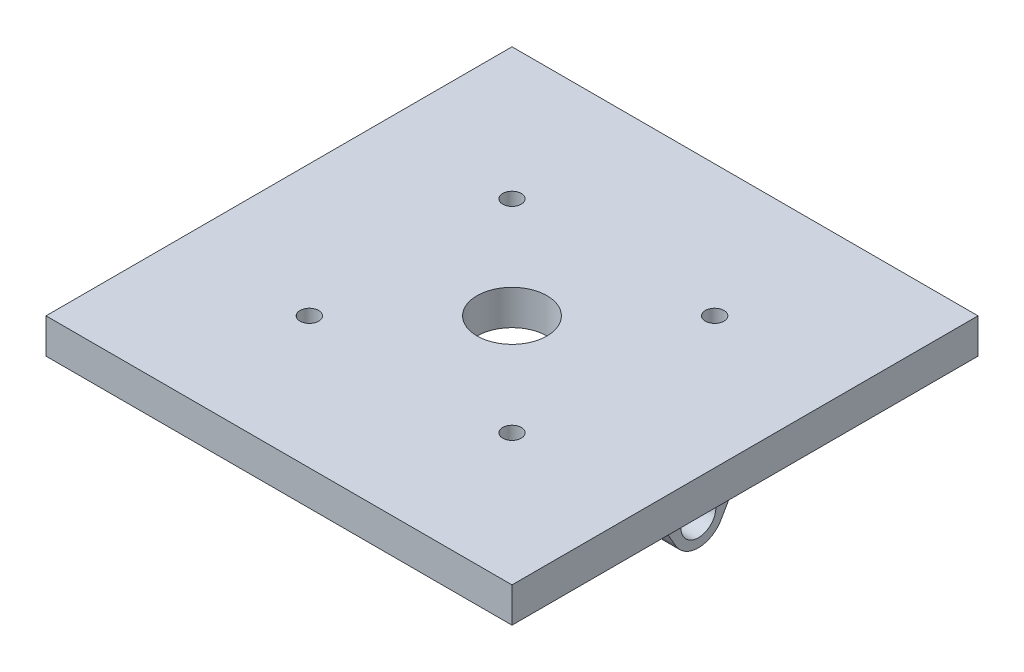
ISO-10303-21;
HEADER;
FILE_DESCRIPTION(('STEP AP214'),'2;1');
FILE_NAME('part.step','',(''),(''),'','','');
FILE_SCHEMA(('AUTOMOTIVE_DESIGN { 1 0 10303 214 1 1 1 1 }'));
ENDSEC;
DATA;
#1=APPLICATION_CONTEXT('core data for automotive mechanical design processes');
#2=APPLICATION_PROTOCOL_DEFINITION('international standard','automotive_design',2000,#1);
#3=PRODUCT_CONTEXT('',#1,'mechanical');
#4=PRODUCT('Part','Part','',(#3));
#5=PRODUCT_RELATED_PRODUCT_CATEGORY('part','',(#4));
#6=PRODUCT_DEFINITION_FORMATION('','',#4);
#7=PRODUCT_DEFINITION_CONTEXT('part definition',#1,'design');
#8=PRODUCT_DEFINITION('design','',#6,#7);
#9=PRODUCT_DEFINITION_SHAPE('','',#8);
#10=(LENGTH_UNIT() NAMED_UNIT(*) SI_UNIT(.MILLI.,.METRE.));
#11=(NAMED_UNIT(*) PLANE_ANGLE_UNIT() SI_UNIT($,.RADIAN.));
#12=(NAMED_UNIT(*) SI_UNIT($,.STERADIAN.) SOLID_ANGLE_UNIT());
#13=UNCERTAINTY_MEASURE_WITH_UNIT(LENGTH_MEASURE(1.E-05),#10,'distance_accuracy_value','');
#14=(GEOMETRIC_REPRESENTATION_CONTEXT(3) GLOBAL_UNCERTAINTY_ASSIGNED_CONTEXT((#13)) GLOBAL_UNIT_ASSIGNED_CONTEXT((#10,
#11,#12)) REPRESENTATION_CONTEXT('',''));
#15=CARTESIAN_POINT('',(0.,0.,0.));
#16=DIRECTION('',(0.,0.,1.));
#17=DIRECTION('',(1.,0.,0.));
#18=AXIS2_PLACEMENT_3D('',#15,#16,#17);
#19=CARTESIAN_POINT('',(0.,0.,0.));
#20=DIRECTION('',(0.,-1.,0.));
#21=DIRECTION('',(0.,0.,-1.));
#22=AXIS2_PLACEMENT_3D('',#19,#20,#21);
#23=PLANE('',#22);
#24=CARTESIAN_POINT('',(-86.974,0.,86.974));
#25=DIRECTION('',(0.,-1.,0.));
#26=DIRECTION('',(0.,0.,-1.));
#27=AXIS2_PLACEMENT_3D('',#24,#25,#26);
#28=CIRCLE('',#27,8.00000000000003);
#29=CARTESIAN_POINT('',(-86.974,0.,78.974));
#30=VERTEX_POINT('',#29);
#31=EDGE_CURVE('E413',#30,#30,#28,.T.);
#32=ORIENTED_EDGE('',*,*,#31,.F.);
#33=EDGE_LOOP('',(#32));
#34=FACE_BOUND('',#33,.T.);
#35=CARTESIAN_POINT('',(86.974,0.,86.974));
#36=DIRECTION('',(0.,-1.,0.));
#37=DIRECTION('',(0.,0.,-1.));
#38=AXIS2_PLACEMENT_3D('',#35,#36,#37);
#39=CIRCLE('',#38,8.00000000000004);
#40=CARTESIAN_POINT('',(86.974,0.,78.974));
#41=VERTEX_POINT('',#40);
#42=EDGE_CURVE('E423',#41,#41,#39,.T.);
#43=ORIENTED_EDGE('',*,*,#42,.F.);
#44=EDGE_LOOP('',(#43));
#45=FACE_BOUND('',#44,.T.);
#46=CARTESIAN_POINT('',(86.974,0.,-86.974));
#47=DIRECTION('',(0.,-1.,0.));
#48=DIRECTION('',(0.,0.,-1.));
#49=AXIS2_PLACEMENT_3D('',#46,#47,#48);
#50=CIRCLE('',#49,8.00000000000004);
#51=CARTESIAN_POINT('',(86.974,0.,-94.974));
#52=VERTEX_POINT('',#51);
#53=EDGE_CURVE('E429',#52,#52,#50,.T.);
#54=ORIENTED_EDGE('',*,*,#53,.F.);
#55=EDGE_LOOP('',(#54));
#56=FACE_BOUND('',#55,.T.);
#57=CARTESIAN_POINT('',(-86.974,0.,-86.974));
#58=DIRECTION('',(0.,-1.,0.));
#59=DIRECTION('',(0.,0.,-1.));
#60=AXIS2_PLACEMENT_3D('',#57,#58,#59);
#61=CIRCLE('',#60,8.00000000000003);
#62=CARTESIAN_POINT('',(-86.974,0.,-94.974));
#63=VERTEX_POINT('',#62);
#64=EDGE_CURVE('E435',#63,#63,#61,.T.);
#65=ORIENTED_EDGE('',*,*,#64,.F.);
#66=EDGE_LOOP('',(#65));
#67=FACE_BOUND('',#66,.T.);
#68=DIRECTION('',(0.,0.,1.));
#69=VECTOR('',#68,1.);
#70=CARTESIAN_POINT('',(-160.,0.,57.7350269189629));
#71=LINE('',#70,#69);
#72=CARTESIAN_POINT('',(-160.,0.,-57.7350269189629));
#73=VERTEX_POINT('',#72);
#74=CARTESIAN_POINT('',(-160.,0.,57.7350269189629));
#75=VERTEX_POINT('',#74);
#76=EDGE_CURVE('E176',#73,#75,#71,.T.);
#77=ORIENTED_EDGE('',*,*,#76,.T.);
#78=DIRECTION('',(1.,0.,0.));
#79=VECTOR('',#78,1.);
#80=CARTESIAN_POINT('',(-160.,0.,57.7350269189629));
#81=LINE('',#80,#79);
#82=CARTESIAN_POINT('',(-130.,0.,57.7350269189629));
#83=VERTEX_POINT('',#82);
#84=EDGE_CURVE('E203',#75,#83,#81,.T.);
#85=ORIENTED_EDGE('',*,*,#84,.T.);
#86=DIRECTION('',(0.,0.,1.));
#87=VECTOR('',#86,1.);
#88=CARTESIAN_POINT('',(-130.,0.,57.7350269189629));
#89=LINE('',#88,#87);
#90=CARTESIAN_POINT('',(-130.,0.,-57.7350269189629));
#91=VERTEX_POINT('',#90);
#92=EDGE_CURVE('E194',#91,#83,#89,.T.);
#93=ORIENTED_EDGE('',*,*,#92,.F.);
#94=DIRECTION('',(1.,0.,0.));
#95=VECTOR('',#94,1.);
#96=CARTESIAN_POINT('',(-160.,0.,-57.7350269189629));
#97=LINE('',#96,#95);
#98=EDGE_CURVE('E201',#73,#91,#97,.T.);
#99=ORIENTED_EDGE('',*,*,#98,.F.);
#100=EDGE_LOOP('',(#77,#85,#93,#99));
#101=FACE_BOUND('',#100,.T.);
#102=DIRECTION('',(0.,0.,-1.));
#103=VECTOR('',#102,1.);
#104=CARTESIAN_POINT('',(200.,0.,200.));
#105=LINE('',#104,#103);
#106=CARTESIAN_POINT('',(200.,0.,200.));
#107=VERTEX_POINT('',#106);
#108=CARTESIAN_POINT('',(200.,0.,-200.));
#109=VERTEX_POINT('',#108);
#110=EDGE_CURVE('E259',#107,#109,#105,.T.);
#111=ORIENTED_EDGE('',*,*,#110,.F.);
#112=DIRECTION('',(1.,0.,0.));
#113=VECTOR('',#112,1.);
#114=CARTESIAN_POINT('',(-200.,0.,200.));
#115=LINE('',#114,#113);
#116=CARTESIAN_POINT('',(-200.,0.,200.));
#117=VERTEX_POINT('',#116);
#118=EDGE_CURVE('E266',#117,#107,#115,.T.);
#119=ORIENTED_EDGE('',*,*,#118,.F.);
#120=DIRECTION('',(0.,0.,1.));
#121=VECTOR('',#120,1.);
#122=CARTESIAN_POINT('',(-200.,0.,200.));
#123=LINE('',#122,#121);
#124=CARTESIAN_POINT('',(-200.,0.,-200.));
#125=VERTEX_POINT('',#124);
#126=EDGE_CURVE('E277',#125,#117,#123,.T.);
#127=ORIENTED_EDGE('',*,*,#126,.F.);
#128=DIRECTION('',(-1.,0.,0.));
#129=VECTOR('',#128,1.);
#130=CARTESIAN_POINT('',(-200.,0.,-200.));
#131=LINE('',#130,#129);
#132=EDGE_CURVE('E275',#109,#125,#131,.T.);
#133=ORIENTED_EDGE('',*,*,#132,.F.);
#134=EDGE_LOOP('',(#111,#119,#127,#133));
#135=FACE_BOUND('',#134,.T.);
#136=CARTESIAN_POINT('',(0.,0.,0.));
#137=DIRECTION('',(0.,1.,0.));
#138=DIRECTION('',(0.,0.,1.));
#139=AXIS2_PLACEMENT_3D('',#136,#137,#138);
#140=CIRCLE('',#139,30.);
#141=CARTESIAN_POINT('',(0.,0.,30.));
#142=VERTEX_POINT('',#141);
#143=EDGE_CURVE('E255',#142,#142,#140,.T.);
#144=ORIENTED_EDGE('',*,*,#143,.T.);
#145=EDGE_LOOP('',(#144));
#146=FACE_BOUND('',#145,.T.);
#147=DIRECTION('',(0.,0.,1.));
#148=VECTOR('',#147,1.);
#149=CARTESIAN_POINT('',(160.,0.,57.7350269189629));
#150=LINE('',#149,#148);
#151=CARTESIAN_POINT('',(160.,0.,-57.7350269189629));
#152=VERTEX_POINT('',#151);
#153=CARTESIAN_POINT('',(160.,0.,57.7350269189629));
#154=VERTEX_POINT('',#153);
#155=EDGE_CURVE('E56',#152,#154,#150,.T.);
#156=ORIENTED_EDGE('',*,*,#155,.F.);
#157=DIRECTION('',(-1.,0.,0.));
#158=VECTOR('',#157,1.);
#159=CARTESIAN_POINT('',(160.,0.,-57.7350269189629));
#160=LINE('',#159,#158);
#161=CARTESIAN_POINT('',(130.,0.,-57.7350269189629));
#162=VERTEX_POINT('',#161);
#163=EDGE_CURVE('E247',#152,#162,#160,.T.);
#164=ORIENTED_EDGE('',*,*,#163,.T.);
#165=DIRECTION('',(0.,0.,1.));
#166=VECTOR('',#165,1.);
#167=CARTESIAN_POINT('',(130.,0.,57.7350269189629));
#168=LINE('',#167,#166);
#169=CARTESIAN_POINT('',(130.,0.,57.7350269189629));
#170=VERTEX_POINT('',#169);
#171=EDGE_CURVE('E234',#162,#170,#168,.T.);
#172=ORIENTED_EDGE('',*,*,#171,.T.);
#173=DIRECTION('',(-1.,0.,0.));
#174=VECTOR('',#173,1.);
#175=CARTESIAN_POINT('',(160.,0.,57.7350269189629));
#176=LINE('',#175,#174);
#177=EDGE_CURVE('E244',#154,#170,#176,.T.);
#178=ORIENTED_EDGE('',*,*,#177,.F.);
#179=EDGE_LOOP('',(#156,#164,#172,#178));
#180=FACE_BOUND('',#179,.T.);
#181=ADVANCED_FACE('F33',(#34,#45,#56,#67,#101,#135,#146,#180),#23,.T.);
#182=CARTESIAN_POINT('',(0.,30.,0.));
#183=DIRECTION('',(0.,-1.,0.));
#184=DIRECTION('',(0.,0.,-1.));
#185=AXIS2_PLACEMENT_3D('',#182,#183,#184);
#186=PLANE('',#185);
#187=CARTESIAN_POINT('',(-86.974,30.,86.974));
#188=DIRECTION('',(0.,1.,0.));
#189=DIRECTION('',(0.,0.,-1.));
#190=AXIS2_PLACEMENT_3D('',#187,#188,#189);
#191=CIRCLE('',#190,8.00000000000003);
#192=CARTESIAN_POINT('',(-86.974,30.,78.974));
#193=VERTEX_POINT('',#192);
#194=EDGE_CURVE('E416',#193,#193,#191,.T.);
#195=ORIENTED_EDGE('',*,*,#194,.F.);
#196=EDGE_LOOP('',(#195));
#197=FACE_BOUND('',#196,.T.);
#198=CARTESIAN_POINT('',(86.974,30.,86.974));
#199=DIRECTION('',(0.,1.,0.));
#200=DIRECTION('',(0.,0.,1.));
#201=AXIS2_PLACEMENT_3D('',#198,#199,#200);
#202=CIRCLE('',#201,8.00000000000004);
#203=CARTESIAN_POINT('',(86.974,30.,94.974));
#204=VERTEX_POINT('',#203);
#205=EDGE_CURVE('E418',#204,#204,#202,.T.);
#206=ORIENTED_EDGE('',*,*,#205,.F.);
#207=EDGE_LOOP('',(#206));
#208=FACE_BOUND('',#207,.T.);
#209=CARTESIAN_POINT('',(86.974,30.,-86.974));
#210=DIRECTION('',(0.,1.,0.));
#211=DIRECTION('',(0.,0.,-1.));
#212=AXIS2_PLACEMENT_3D('',#209,#210,#211);
#213=CIRCLE('',#212,8.00000000000004);
#214=CARTESIAN_POINT('',(86.974,30.,-94.974));
#215=VERTEX_POINT('',#214);
#216=EDGE_CURVE('E426',#215,#215,#213,.T.);
#217=ORIENTED_EDGE('',*,*,#216,.F.);
#218=EDGE_LOOP('',(#217));
#219=FACE_BOUND('',#218,.T.);
#220=CARTESIAN_POINT('',(-86.974,30.,-86.974));
#221=DIRECTION('',(0.,1.,0.));
#222=DIRECTION('',(0.,0.,1.));
#223=AXIS2_PLACEMENT_3D('',#220,#221,#222);
#224=CIRCLE('',#223,8.00000000000003);
#225=CARTESIAN_POINT('',(-86.974,30.,-78.974));
#226=VERTEX_POINT('',#225);
#227=EDGE_CURVE('E432',#226,#226,#224,.T.);
#228=ORIENTED_EDGE('',*,*,#227,.F.);
#229=EDGE_LOOP('',(#228));
#230=FACE_BOUND('',#229,.T.);
#231=DIRECTION('',(0.,0.,-1.));
#232=VECTOR('',#231,1.);
#233=CARTESIAN_POINT('',(200.,30.,200.));
#234=LINE('',#233,#232);
#235=CARTESIAN_POINT('',(200.,30.,200.));
#236=VERTEX_POINT('',#235);
#237=CARTESIAN_POINT('',(200.,30.,-200.));
#238=VERTEX_POINT('',#237);
#239=EDGE_CURVE('E262',#236,#238,#234,.T.);
#240=ORIENTED_EDGE('',*,*,#239,.T.);
#241=DIRECTION('',(-1.,0.,0.));
#242=VECTOR('',#241,1.);
#243=CARTESIAN_POINT('',(-200.,30.,-200.));
#244=LINE('',#243,#242);
#245=CARTESIAN_POINT('',(-200.,30.,-200.));
#246=VERTEX_POINT('',#245);
#247=EDGE_CURVE('E265',#238,#246,#244,.T.);
#248=ORIENTED_EDGE('',*,*,#247,.T.);
#249=DIRECTION('',(0.,0.,1.));
#250=VECTOR('',#249,1.);
#251=CARTESIAN_POINT('',(-200.,30.,200.));
#252=LINE('',#251,#250);
#253=CARTESIAN_POINT('',(-200.,30.,200.));
#254=VERTEX_POINT('',#253);
#255=EDGE_CURVE('E268',#246,#254,#252,.T.);
#256=ORIENTED_EDGE('',*,*,#255,.T.);
#257=DIRECTION('',(1.,0.,0.));
#258=VECTOR('',#257,1.);
#259=CARTESIAN_POINT('',(-200.,30.,200.));
#260=LINE('',#259,#258);
#261=EDGE_CURVE('E270',#254,#236,#260,.T.);
#262=ORIENTED_EDGE('',*,*,#261,.T.);
#263=EDGE_LOOP('',(#240,#248,#256,#262));
#264=FACE_BOUND('',#263,.T.);
#265=CARTESIAN_POINT('',(0.,30.,0.));
#266=DIRECTION('',(0.,1.,0.));
#267=DIRECTION('',(0.,0.,1.));
#268=AXIS2_PLACEMENT_3D('',#265,#266,#267);
#269=CIRCLE('',#268,30.);
#270=CARTESIAN_POINT('',(0.,30.,30.));
#271=VERTEX_POINT('',#270);
#272=EDGE_CURVE('E256',#271,#271,#269,.T.);
#273=ORIENTED_EDGE('',*,*,#272,.F.);
#274=EDGE_LOOP('',(#273));
#275=FACE_BOUND('',#274,.T.);
#276=ADVANCED_FACE('F304',(#197,#208,#219,#230,#264,#275),#186,.F.);
#277=CARTESIAN_POINT('',(200.,30.,200.));
#278=DIRECTION('',(-1.,0.,0.));
#279=DIRECTION('',(0.,0.,1.));
#280=AXIS2_PLACEMENT_3D('',#277,#278,#279);
#281=PLANE('',#280);
#282=ORIENTED_EDGE('',*,*,#110,.T.);
#283=DIRECTION('',(0.,-1.,0.));
#284=VECTOR('',#283,1.);
#285=CARTESIAN_POINT('',(200.,30.,-200.));
#286=LINE('',#285,#284);
#287=EDGE_CURVE('E11',#238,#109,#286,.T.);
#288=ORIENTED_EDGE('',*,*,#287,.F.);
#289=ORIENTED_EDGE('',*,*,#239,.F.);
#290=DIRECTION('',(0.,-1.,0.));
#291=VECTOR('',#290,1.);
#292=CARTESIAN_POINT('',(200.,30.,200.));
#293=LINE('',#292,#291);
#294=EDGE_CURVE('E272',#236,#107,#293,.T.);
#295=ORIENTED_EDGE('',*,*,#294,.T.);
#296=EDGE_LOOP('',(#282,#288,#289,#295));
#297=FACE_BOUND('',#296,.T.);
#298=ADVANCED_FACE('F35',(#297),#281,.F.);
#299=CARTESIAN_POINT('',(-200.,30.,-200.));
#300=DIRECTION('',(0.,0.,1.));
#301=DIRECTION('',(1.,0.,0.));
#302=AXIS2_PLACEMENT_3D('',#299,#300,#301);
#303=PLANE('',#302);
#304=ORIENTED_EDGE('',*,*,#132,.T.);
#305=DIRECTION('',(0.,-1.,0.));
#306=VECTOR('',#305,1.);
#307=CARTESIAN_POINT('',(-200.,30.,-200.));
#308=LINE('',#307,#306);
#309=EDGE_CURVE('E41',#246,#125,#308,.T.);
#310=ORIENTED_EDGE('',*,*,#309,.F.);
#311=ORIENTED_EDGE('',*,*,#247,.F.);
#312=ORIENTED_EDGE('',*,*,#287,.T.);
#313=EDGE_LOOP('',(#304,#310,#311,#312));
#314=FACE_BOUND('',#313,.T.);
#315=ADVANCED_FACE('F306',(#314),#303,.F.);
#316=CARTESIAN_POINT('',(-200.,30.,200.));
#317=DIRECTION('',(1.,0.,0.));
#318=DIRECTION('',(0.,0.,-1.));
#319=AXIS2_PLACEMENT_3D('',#316,#317,#318);
#320=PLANE('',#319);
#321=ORIENTED_EDGE('',*,*,#126,.T.);
#322=DIRECTION('',(0.,-1.,0.));
#323=VECTOR('',#322,1.);
#324=CARTESIAN_POINT('',(-200.,30.,200.));
#325=LINE('',#324,#323);
#326=EDGE_CURVE('E282',#254,#117,#325,.T.);
#327=ORIENTED_EDGE('',*,*,#326,.F.);
#328=ORIENTED_EDGE('',*,*,#255,.F.);
#329=ORIENTED_EDGE('',*,*,#309,.T.);
#330=EDGE_LOOP('',(#321,#327,#328,#329));
#331=FACE_BOUND('',#330,.T.);
#332=ADVANCED_FACE('F289',(#331),#320,.F.);
#333=CARTESIAN_POINT('',(-200.,30.,200.));
#334=DIRECTION('',(0.,0.,-1.));
#335=DIRECTION('',(-1.,0.,0.));
#336=AXIS2_PLACEMENT_3D('',#333,#334,#335);
#337=PLANE('',#336);
#338=ORIENTED_EDGE('',*,*,#118,.T.);
#339=ORIENTED_EDGE('',*,*,#294,.F.);
#340=ORIENTED_EDGE('',*,*,#261,.F.);
#341=ORIENTED_EDGE('',*,*,#326,.T.);
#342=EDGE_LOOP('',(#338,#339,#340,#341));
#343=FACE_BOUND('',#342,.T.);
#344=ADVANCED_FACE('F298',(#343),#337,.F.);
#345=CARTESIAN_POINT('',(0.,30.,0.));
#346=DIRECTION('',(0.,-1.,0.));
#347=DIRECTION('',(0.,0.,-1.));
#348=AXIS2_PLACEMENT_3D('',#345,#346,#347);
#349=CYLINDRICAL_SURFACE('',#348,30.);
#350=ORIENTED_EDGE('',*,*,#272,.T.);
#351=EDGE_LOOP('',(#350));
#352=FACE_BOUND('',#351,.T.);
#353=ORIENTED_EDGE('',*,*,#143,.F.);
#354=EDGE_LOOP('',(#353));
#355=FACE_BOUND('',#354,.T.);
#356=ADVANCED_FACE('F326',(#352,#355),#349,.F.);
#357=CARTESIAN_POINT('',(160.,-40.,0.));
#358=DIRECTION('',(1.,0.,0.));
#359=DIRECTION('',(0.,0.,-1.));
#360=AXIS2_PLACEMENT_3D('',#357,#358,#359);
#361=PLANE('',#360);
#362=CARTESIAN_POINT('',(160.,-40.,0.));
#363=DIRECTION('',(1.,0.,0.));
#364=DIRECTION('',(0.,0.,-1.));
#365=AXIS2_PLACEMENT_3D('',#362,#363,#364);
#366=CIRCLE('',#365,22.5);
#367=CARTESIAN_POINT('',(160.,-51.2500000000001,19.4855715851498));
#368=VERTEX_POINT('',#367);
#369=CARTESIAN_POINT('',(160.,-51.2500000000001,-19.4855715851498));
#370=VERTEX_POINT('',#369);
#371=EDGE_CURVE('E213',#368,#370,#366,.T.);
#372=ORIENTED_EDGE('',*,*,#371,.T.);
#373=DIRECTION('',(0.,0.866025403784436,-0.500000000000004));
#374=VECTOR('',#373,1.);
#375=CARTESIAN_POINT('',(160.,-51.2500000000001,-19.4855715851498));
#376=LINE('',#375,#374);
#377=CARTESIAN_POINT('',(160.,-7.49999999999995,-44.7446458621963));
#378=VERTEX_POINT('',#377);
#379=EDGE_CURVE('E216',#370,#378,#376,.T.);
#380=ORIENTED_EDGE('',*,*,#379,.T.);
#381=CARTESIAN_POINT('',(160.,-15.,-57.7350269189629));
#382=DIRECTION('',(-1.,0.,0.));
#383=DIRECTION('',(0.,0.,1.));
#384=AXIS2_PLACEMENT_3D('',#381,#382,#383);
#385=CIRCLE('',#384,15.);
#386=EDGE_CURVE('E219',#378,#152,#385,.T.);
#387=ORIENTED_EDGE('',*,*,#386,.T.);
#388=ORIENTED_EDGE('',*,*,#155,.T.);
#389=CARTESIAN_POINT('',(160.,-15.,57.7350269189629));
#390=DIRECTION('',(-1.,0.,0.));
#391=DIRECTION('',(0.,0.,-1.));
#392=AXIS2_PLACEMENT_3D('',#389,#390,#391);
#393=CIRCLE('',#392,15.);
#394=CARTESIAN_POINT('',(160.,-7.49999999999996,44.7446458621963));
#395=VERTEX_POINT('',#394);
#396=EDGE_CURVE('E222',#154,#395,#393,.T.);
#397=ORIENTED_EDGE('',*,*,#396,.T.);
#398=DIRECTION('',(0.,-0.866025403784436,-0.500000000000004));
#399=VECTOR('',#398,1.);
#400=CARTESIAN_POINT('',(160.,-51.2500000000001,19.4855715851498));
#401=LINE('',#400,#399);
#402=EDGE_CURVE('E224',#395,#368,#401,.T.);
#403=ORIENTED_EDGE('',*,*,#402,.T.);
#404=EDGE_LOOP('',(#372,#380,#387,#388,#397,#403));
#405=FACE_BOUND('',#404,.T.);
#406=CARTESIAN_POINT('',(160.,-40.,0.));
#407=DIRECTION('',(1.,0.,0.));
#408=DIRECTION('',(0.,0.,-1.));
#409=AXIS2_PLACEMENT_3D('',#406,#407,#408);
#410=CIRCLE('',#409,15.);
#411=CARTESIAN_POINT('',(160.,-40.,-15.));
#412=VERTEX_POINT('',#411);
#413=EDGE_CURVE('E207',#412,#412,#410,.T.);
#414=ORIENTED_EDGE('',*,*,#413,.F.);
#415=EDGE_LOOP('',(#414));
#416=FACE_BOUND('',#415,.T.);
#417=ADVANCED_FACE('F330',(#405,#416),#361,.T.);
#418=CARTESIAN_POINT('',(130.,-40.,0.));
#419=DIRECTION('',(1.,0.,0.));
#420=DIRECTION('',(0.,0.,-1.));
#421=AXIS2_PLACEMENT_3D('',#418,#419,#420);
#422=PLANE('',#421);
#423=CARTESIAN_POINT('',(130.,-40.,0.));
#424=DIRECTION('',(1.,0.,0.));
#425=DIRECTION('',(0.,0.,-1.));
#426=AXIS2_PLACEMENT_3D('',#423,#424,#425);
#427=CIRCLE('',#426,22.5);
#428=CARTESIAN_POINT('',(130.,-51.2500000000001,19.4855715851498));
#429=VERTEX_POINT('',#428);
#430=CARTESIAN_POINT('',(130.,-51.2500000000001,-19.4855715851498));
#431=VERTEX_POINT('',#430);
#432=EDGE_CURVE('E210',#429,#431,#427,.T.);
#433=ORIENTED_EDGE('',*,*,#432,.F.);
#434=DIRECTION('',(0.,-0.866025403784436,-0.500000000000004));
#435=VECTOR('',#434,1.);
#436=CARTESIAN_POINT('',(130.,-51.2500000000001,19.4855715851498));
#437=LINE('',#436,#435);
#438=CARTESIAN_POINT('',(130.,-7.49999999999996,44.7446458621963));
#439=VERTEX_POINT('',#438);
#440=EDGE_CURVE('E217',#439,#429,#437,.T.);
#441=ORIENTED_EDGE('',*,*,#440,.F.);
#442=CARTESIAN_POINT('',(130.,-15.,57.7350269189629));
#443=DIRECTION('',(-1.,0.,0.));
#444=DIRECTION('',(0.,0.,-1.));
#445=AXIS2_PLACEMENT_3D('',#442,#443,#444);
#446=CIRCLE('',#445,15.);
#447=EDGE_CURVE('E236',#170,#439,#446,.T.);
#448=ORIENTED_EDGE('',*,*,#447,.F.);
#449=ORIENTED_EDGE('',*,*,#171,.F.);
#450=CARTESIAN_POINT('',(130.,-15.,-57.7350269189629));
#451=DIRECTION('',(-1.,0.,0.));
#452=DIRECTION('',(0.,0.,1.));
#453=AXIS2_PLACEMENT_3D('',#450,#451,#452);
#454=CIRCLE('',#453,15.);
#455=CARTESIAN_POINT('',(130.,-7.49999999999995,-44.7446458621963));
#456=VERTEX_POINT('',#455);
#457=EDGE_CURVE('E231',#456,#162,#454,.T.);
#458=ORIENTED_EDGE('',*,*,#457,.F.);
#459=DIRECTION('',(0.,0.866025403784436,-0.500000000000004));
#460=VECTOR('',#459,1.);
#461=CARTESIAN_POINT('',(130.,-51.2500000000001,-19.4855715851498));
#462=LINE('',#461,#460);
#463=EDGE_CURVE('E229',#431,#456,#462,.T.);
#464=ORIENTED_EDGE('',*,*,#463,.F.);
#465=EDGE_LOOP('',(#433,#441,#448,#449,#458,#464));
#466=FACE_BOUND('',#465,.T.);
#467=CARTESIAN_POINT('',(130.,-40.,0.));
#468=DIRECTION('',(1.,0.,0.));
#469=DIRECTION('',(0.,0.,-1.));
#470=AXIS2_PLACEMENT_3D('',#467,#468,#469);
#471=CIRCLE('',#470,15.);
#472=CARTESIAN_POINT('',(130.,-40.,-15.));
#473=VERTEX_POINT('',#472);
#474=EDGE_CURVE('E159',#473,#473,#471,.T.);
#475=ORIENTED_EDGE('',*,*,#474,.T.);
#476=EDGE_LOOP('',(#475));
#477=FACE_BOUND('',#476,.T.);
#478=ADVANCED_FACE('F335',(#466,#477),#422,.F.);
#479=CARTESIAN_POINT('',(160.,-40.,0.));
#480=DIRECTION('',(-1.,0.,0.));
#481=DIRECTION('',(0.,0.,1.));
#482=AXIS2_PLACEMENT_3D('',#479,#480,#481);
#483=CYLINDRICAL_SURFACE('',#482,22.5);
#484=ORIENTED_EDGE('',*,*,#432,.T.);
#485=DIRECTION('',(-1.,0.,0.));
#486=VECTOR('',#485,1.);
#487=CARTESIAN_POINT('',(160.,-51.2500000000001,-19.4855715851498));
#488=LINE('',#487,#486);
#489=EDGE_CURVE('E252',#370,#431,#488,.T.);
#490=ORIENTED_EDGE('',*,*,#489,.F.);
#491=ORIENTED_EDGE('',*,*,#371,.F.);
#492=DIRECTION('',(-1.,0.,0.));
#493=VECTOR('',#492,1.);
#494=CARTESIAN_POINT('',(160.,-51.2500000000001,19.4855715851498));
#495=LINE('',#494,#493);
#496=EDGE_CURVE('E226',#368,#429,#495,.T.);
#497=ORIENTED_EDGE('',*,*,#496,.T.);
#498=EDGE_LOOP('',(#484,#490,#491,#497));
#499=FACE_BOUND('',#498,.T.);
#500=ADVANCED_FACE('F340',(#499),#483,.T.);
#501=CARTESIAN_POINT('',(160.,-51.2500000000001,-19.4855715851498));
#502=DIRECTION('',(0.,0.500000000000004,0.866025403784436));
#503=DIRECTION('',(0.,-0.866025403784436,0.500000000000004));
#504=AXIS2_PLACEMENT_3D('',#501,#502,#503);
#505=PLANE('',#504);
#506=ORIENTED_EDGE('',*,*,#463,.T.);
#507=DIRECTION('',(-1.,0.,0.));
#508=VECTOR('',#507,1.);
#509=CARTESIAN_POINT('',(160.,-7.49999999999995,-44.7446458621963));
#510=LINE('',#509,#508);
#511=EDGE_CURVE('E249',#378,#456,#510,.T.);
#512=ORIENTED_EDGE('',*,*,#511,.F.);
#513=ORIENTED_EDGE('',*,*,#379,.F.);
#514=ORIENTED_EDGE('',*,*,#489,.T.);
#515=EDGE_LOOP('',(#506,#512,#513,#514));
#516=FACE_BOUND('',#515,.T.);
#517=ADVANCED_FACE('F343',(#516),#505,.F.);
#518=CARTESIAN_POINT('',(160.,-15.,-57.7350269189629));
#519=DIRECTION('',(-1.,0.,0.));
#520=DIRECTION('',(0.,0.,1.));
#521=AXIS2_PLACEMENT_3D('',#518,#519,#520);
#522=CYLINDRICAL_SURFACE('',#521,15.);
#523=ORIENTED_EDGE('',*,*,#457,.T.);
#524=ORIENTED_EDGE('',*,*,#163,.F.);
#525=ORIENTED_EDGE('',*,*,#386,.F.);
#526=ORIENTED_EDGE('',*,*,#511,.T.);
#527=EDGE_LOOP('',(#523,#524,#525,#526));
#528=FACE_BOUND('',#527,.T.);
#529=ADVANCED_FACE('F347',(#528),#522,.F.);
#530=CARTESIAN_POINT('',(160.,-15.,57.7350269189629));
#531=DIRECTION('',(-1.,0.,0.));
#532=DIRECTION('',(0.,0.,1.));
#533=AXIS2_PLACEMENT_3D('',#530,#531,#532);
#534=CYLINDRICAL_SURFACE('',#533,15.);
#535=ORIENTED_EDGE('',*,*,#447,.T.);
#536=DIRECTION('',(-1.,0.,0.));
#537=VECTOR('',#536,1.);
#538=CARTESIAN_POINT('',(160.,-7.49999999999996,44.7446458621963));
#539=LINE('',#538,#537);
#540=EDGE_CURVE('E241',#395,#439,#539,.T.);
#541=ORIENTED_EDGE('',*,*,#540,.F.);
#542=ORIENTED_EDGE('',*,*,#396,.F.);
#543=ORIENTED_EDGE('',*,*,#177,.T.);
#544=EDGE_LOOP('',(#535,#541,#542,#543));
#545=FACE_BOUND('',#544,.T.);
#546=ADVANCED_FACE('F351',(#545),#534,.F.);
#547=CARTESIAN_POINT('',(160.,-51.2500000000001,19.4855715851498));
#548=DIRECTION('',(0.,0.500000000000004,-0.866025403784436));
#549=DIRECTION('',(0.,0.866025403784436,0.500000000000004));
#550=AXIS2_PLACEMENT_3D('',#547,#548,#549);
#551=PLANE('',#550);
#552=ORIENTED_EDGE('',*,*,#440,.T.);
#553=ORIENTED_EDGE('',*,*,#496,.F.);
#554=ORIENTED_EDGE('',*,*,#402,.F.);
#555=ORIENTED_EDGE('',*,*,#540,.T.);
#556=EDGE_LOOP('',(#552,#553,#554,#555));
#557=FACE_BOUND('',#556,.T.);
#558=ADVANCED_FACE('F355',(#557),#551,.F.);
#559=CARTESIAN_POINT('',(160.,-40.,0.));
#560=DIRECTION('',(-1.,0.,0.));
#561=DIRECTION('',(0.,0.,1.));
#562=AXIS2_PLACEMENT_3D('',#559,#560,#561);
#563=CYLINDRICAL_SURFACE('',#562,15.);
#564=ORIENTED_EDGE('',*,*,#413,.T.);
#565=EDGE_LOOP('',(#564));
#566=FACE_BOUND('',#565,.T.);
#567=ORIENTED_EDGE('',*,*,#474,.F.);
#568=EDGE_LOOP('',(#567));
#569=FACE_BOUND('',#568,.T.);
#570=ADVANCED_FACE('F359',(#566,#569),#563,.F.);
#571=CARTESIAN_POINT('',(-160.,-40.,0.));
#572=DIRECTION('',(1.,0.,0.));
#573=DIRECTION('',(0.,0.,-1.));
#574=AXIS2_PLACEMENT_3D('',#571,#572,#573);
#575=CYLINDRICAL_SURFACE('',#574,22.5);
#576=CARTESIAN_POINT('',(-130.,-40.,0.));
#577=DIRECTION('',(1.,0.,0.));
#578=DIRECTION('',(0.,0.,-1.));
#579=AXIS2_PLACEMENT_3D('',#576,#577,#578);
#580=CIRCLE('',#579,22.5);
#581=CARTESIAN_POINT('',(-130.,-51.2500000000001,19.4855715851498));
#582=VERTEX_POINT('',#581);
#583=CARTESIAN_POINT('',(-130.,-51.2500000000001,-19.4855715851498));
#584=VERTEX_POINT('',#583);
#585=EDGE_CURVE('E154',#582,#584,#580,.T.);
#586=ORIENTED_EDGE('',*,*,#585,.F.);
#587=DIRECTION('',(1.,0.,0.));
#588=VECTOR('',#587,1.);
#589=CARTESIAN_POINT('',(-160.,-51.2500000000001,19.4855715851498));
#590=LINE('',#589,#588);
#591=CARTESIAN_POINT('',(-160.,-51.2500000000001,19.4855715851498));
#592=VERTEX_POINT('',#591);
#593=EDGE_CURVE('E148',#592,#582,#590,.T.);
#594=ORIENTED_EDGE('',*,*,#593,.F.);
#595=CARTESIAN_POINT('',(-160.,-40.,0.));
#596=DIRECTION('',(1.,0.,0.));
#597=DIRECTION('',(0.,0.,-1.));
#598=AXIS2_PLACEMENT_3D('',#595,#596,#597);
#599=CIRCLE('',#598,22.5);
#600=CARTESIAN_POINT('',(-160.,-51.2500000000001,-19.4855715851498));
#601=VERTEX_POINT('',#600);
#602=EDGE_CURVE('E151',#592,#601,#599,.T.);
#603=ORIENTED_EDGE('',*,*,#602,.T.);
#604=DIRECTION('',(1.,0.,0.));
#605=VECTOR('',#604,1.);
#606=CARTESIAN_POINT('',(-160.,-51.2500000000001,-19.4855715851498));
#607=LINE('',#606,#605);
#608=EDGE_CURVE('E186',#601,#584,#607,.T.);
#609=ORIENTED_EDGE('',*,*,#608,.T.);
#610=EDGE_LOOP('',(#586,#594,#603,#609));
#611=FACE_BOUND('',#610,.T.);
#612=ADVANCED_FACE('F150',(#611),#575,.T.);
#613=CARTESIAN_POINT('',(-160.,-51.2500000000001,19.4855715851498));
#614=DIRECTION('',(0.,-0.500000000000004,0.866025403784436));
#615=DIRECTION('',(0.,-0.866025403784436,-0.500000000000004));
#616=AXIS2_PLACEMENT_3D('',#613,#614,#615);
#617=PLANE('',#616);
#618=DIRECTION('',(0.,-0.866025403784436,-0.500000000000004));
#619=VECTOR('',#618,1.);
#620=CARTESIAN_POINT('',(-130.,-51.2500000000001,19.4855715851498));
#621=LINE('',#620,#619);
#622=CARTESIAN_POINT('',(-130.,-7.49999999999996,44.7446458621963));
#623=VERTEX_POINT('',#622);
#624=EDGE_CURVE('E188',#623,#582,#621,.T.);
#625=ORIENTED_EDGE('',*,*,#624,.F.);
#626=DIRECTION('',(1.,0.,0.));
#627=VECTOR('',#626,1.);
#628=CARTESIAN_POINT('',(-160.,-7.49999999999996,44.7446458621963));
#629=LINE('',#628,#627);
#630=CARTESIAN_POINT('',(-160.,-7.49999999999996,44.7446458621963));
#631=VERTEX_POINT('',#630);
#632=EDGE_CURVE('E160',#631,#623,#629,.T.);
#633=ORIENTED_EDGE('',*,*,#632,.F.);
#634=DIRECTION('',(0.,-0.866025403784436,-0.500000000000004));
#635=VECTOR('',#634,1.);
#636=CARTESIAN_POINT('',(-160.,-51.2500000000001,19.4855715851498));
#637=LINE('',#636,#635);
#638=EDGE_CURVE('E166',#631,#592,#637,.T.);
#639=ORIENTED_EDGE('',*,*,#638,.T.);
#640=ORIENTED_EDGE('',*,*,#593,.T.);
#641=EDGE_LOOP('',(#625,#633,#639,#640));
#642=FACE_BOUND('',#641,.T.);
#643=ADVANCED_FACE('F173',(#642),#617,.T.);
#644=CARTESIAN_POINT('',(-160.,-15.,57.7350269189629));
#645=DIRECTION('',(1.,0.,0.));
#646=DIRECTION('',(0.,0.,-1.));
#647=AXIS2_PLACEMENT_3D('',#644,#645,#646);
#648=CYLINDRICAL_SURFACE('',#647,15.);
#649=CARTESIAN_POINT('',(-130.,-15.,57.7350269189629));
#650=DIRECTION('',(-1.,0.,0.));
#651=DIRECTION('',(0.,0.,-1.));
#652=AXIS2_PLACEMENT_3D('',#649,#650,#651);
#653=CIRCLE('',#652,15.);
#654=EDGE_CURVE('E191',#83,#623,#653,.T.);
#655=ORIENTED_EDGE('',*,*,#654,.F.);
#656=ORIENTED_EDGE('',*,*,#84,.F.);
#657=CARTESIAN_POINT('',(-160.,-15.,57.7350269189629));
#658=DIRECTION('',(-1.,0.,0.));
#659=DIRECTION('',(0.,0.,-1.));
#660=AXIS2_PLACEMENT_3D('',#657,#658,#659);
#661=CIRCLE('',#660,15.);
#662=EDGE_CURVE('E174',#75,#631,#661,.T.);
#663=ORIENTED_EDGE('',*,*,#662,.T.);
#664=ORIENTED_EDGE('',*,*,#632,.T.);
#665=EDGE_LOOP('',(#655,#656,#663,#664));
#666=FACE_BOUND('',#665,.T.);
#667=ADVANCED_FACE('F371',(#666),#648,.F.);
#668=CARTESIAN_POINT('',(-160.,-15.,-57.7350269189629));
#669=DIRECTION('',(1.,0.,0.));
#670=DIRECTION('',(0.,0.,-1.));
#671=AXIS2_PLACEMENT_3D('',#668,#669,#670);
#672=CYLINDRICAL_SURFACE('',#671,15.);
#673=CARTESIAN_POINT('',(-130.,-15.,-57.7350269189629));
#674=DIRECTION('',(-1.,0.,0.));
#675=DIRECTION('',(0.,0.,1.));
#676=AXIS2_PLACEMENT_3D('',#673,#674,#675);
#677=CIRCLE('',#676,15.);
#678=CARTESIAN_POINT('',(-130.,-7.49999999999995,-44.7446458621963));
#679=VERTEX_POINT('',#678);
#680=EDGE_CURVE('E48',#679,#91,#677,.T.);
#681=ORIENTED_EDGE('',*,*,#680,.F.);
#682=DIRECTION('',(1.,0.,0.));
#683=VECTOR('',#682,1.);
#684=CARTESIAN_POINT('',(-160.,-7.49999999999995,-44.7446458621963));
#685=LINE('',#684,#683);
#686=CARTESIAN_POINT('',(-160.,-7.49999999999995,-44.7446458621963));
#687=VERTEX_POINT('',#686);
#688=EDGE_CURVE('E199',#687,#679,#685,.T.);
#689=ORIENTED_EDGE('',*,*,#688,.F.);
#690=CARTESIAN_POINT('',(-160.,-15.,-57.7350269189629));
#691=DIRECTION('',(-1.,0.,0.));
#692=DIRECTION('',(0.,0.,1.));
#693=AXIS2_PLACEMENT_3D('',#690,#691,#692);
#694=CIRCLE('',#693,15.);
#695=EDGE_CURVE('E182',#687,#73,#694,.T.);
#696=ORIENTED_EDGE('',*,*,#695,.T.);
#697=ORIENTED_EDGE('',*,*,#98,.T.);
#698=EDGE_LOOP('',(#681,#689,#696,#697));
#699=FACE_BOUND('',#698,.T.);
#700=ADVANCED_FACE('F374',(#699),#672,.F.);
#701=CARTESIAN_POINT('',(-160.,-51.2500000000001,-19.4855715851498));
#702=DIRECTION('',(0.,-0.500000000000004,-0.866025403784436));
#703=DIRECTION('',(0.,0.866025403784436,-0.500000000000004));
#704=AXIS2_PLACEMENT_3D('',#701,#702,#703);
#705=PLANE('',#704);
#706=DIRECTION('',(0.,0.866025403784436,-0.500000000000004));
#707=VECTOR('',#706,1.);
#708=CARTESIAN_POINT('',(-130.,-51.2500000000001,-19.4855715851498));
#709=LINE('',#708,#707);
#710=EDGE_CURVE('E171',#584,#679,#709,.T.);
#711=ORIENTED_EDGE('',*,*,#710,.F.);
#712=ORIENTED_EDGE('',*,*,#608,.F.);
#713=DIRECTION('',(0.,0.866025403784436,-0.500000000000004));
#714=VECTOR('',#713,1.);
#715=CARTESIAN_POINT('',(-160.,-51.2500000000001,-19.4855715851498));
#716=LINE('',#715,#714);
#717=EDGE_CURVE('E170',#601,#687,#716,.T.);
#718=ORIENTED_EDGE('',*,*,#717,.T.);
#719=ORIENTED_EDGE('',*,*,#688,.T.);
#720=EDGE_LOOP('',(#711,#712,#718,#719));
#721=FACE_BOUND('',#720,.T.);
#722=ADVANCED_FACE('F378',(#721),#705,.T.);
#723=CARTESIAN_POINT('',(-160.,-40.,0.));
#724=DIRECTION('',(-1.,0.,0.));
#725=DIRECTION('',(0.,0.,-1.));
#726=AXIS2_PLACEMENT_3D('',#723,#724,#725);
#727=PLANE('',#726);
#728=CARTESIAN_POINT('',(-160.,-40.,0.));
#729=DIRECTION('',(1.,0.,0.));
#730=DIRECTION('',(0.,0.,-1.));
#731=AXIS2_PLACEMENT_3D('',#728,#729,#730);
#732=CIRCLE('',#731,15.);
#733=CARTESIAN_POINT('',(-160.,-40.,-15.));
#734=VERTEX_POINT('',#733);
#735=EDGE_CURVE('E189',#734,#734,#732,.T.);
#736=ORIENTED_EDGE('',*,*,#735,.T.);
#737=EDGE_LOOP('',(#736));
#738=FACE_BOUND('',#737,.T.);
#739=ORIENTED_EDGE('',*,*,#602,.F.);
#740=ORIENTED_EDGE('',*,*,#638,.F.);
#741=ORIENTED_EDGE('',*,*,#662,.F.);
#742=ORIENTED_EDGE('',*,*,#76,.F.);
#743=ORIENTED_EDGE('',*,*,#695,.F.);
#744=ORIENTED_EDGE('',*,*,#717,.F.);
#745=EDGE_LOOP('',(#739,#740,#741,#742,#743,#744));
#746=FACE_BOUND('',#745,.T.);
#747=ADVANCED_FACE('F164',(#738,#746),#727,.T.);
#748=CARTESIAN_POINT('',(-130.,-40.,0.));
#749=DIRECTION('',(-1.,0.,0.));
#750=DIRECTION('',(0.,0.,-1.));
#751=AXIS2_PLACEMENT_3D('',#748,#749,#750);
#752=PLANE('',#751);
#753=CARTESIAN_POINT('',(-130.,-40.,0.));
#754=DIRECTION('',(1.,0.,0.));
#755=DIRECTION('',(0.,0.,-1.));
#756=AXIS2_PLACEMENT_3D('',#753,#754,#755);
#757=CIRCLE('',#756,15.);
#758=CARTESIAN_POINT('',(-130.,-40.,-15.));
#759=VERTEX_POINT('',#758);
#760=EDGE_CURVE('E438',#759,#759,#757,.T.);
#761=ORIENTED_EDGE('',*,*,#760,.F.);
#762=EDGE_LOOP('',(#761));
#763=FACE_BOUND('',#762,.T.);
#764=ORIENTED_EDGE('',*,*,#585,.T.);
#765=ORIENTED_EDGE('',*,*,#710,.T.);
#766=ORIENTED_EDGE('',*,*,#680,.T.);
#767=ORIENTED_EDGE('',*,*,#92,.T.);
#768=ORIENTED_EDGE('',*,*,#654,.T.);
#769=ORIENTED_EDGE('',*,*,#624,.T.);
#770=EDGE_LOOP('',(#764,#765,#766,#767,#768,#769));
#771=FACE_BOUND('',#770,.T.);
#772=ADVANCED_FACE('F383',(#763,#771),#752,.F.);
#773=CARTESIAN_POINT('',(-160.,-40.,0.));
#774=DIRECTION('',(1.,0.,0.));
#775=DIRECTION('',(0.,0.,-1.));
#776=AXIS2_PLACEMENT_3D('',#773,#774,#775);
#777=CYLINDRICAL_SURFACE('',#776,15.);
#778=ORIENTED_EDGE('',*,*,#735,.F.);
#779=EDGE_LOOP('',(#778));
#780=FACE_BOUND('',#779,.T.);
#781=ORIENTED_EDGE('',*,*,#760,.T.);
#782=EDGE_LOOP('',(#781));
#783=FACE_BOUND('',#782,.T.);
#784=ADVANCED_FACE('F386',(#780,#783),#777,.F.);
#785=CARTESIAN_POINT('',(-86.974,-62.5,-86.974));
#786=DIRECTION('',(0.,1.,0.));
#787=DIRECTION('',(0.,0.,1.));
#788=AXIS2_PLACEMENT_3D('',#785,#786,#787);
#789=CYLINDRICAL_SURFACE('',#788,8.00000000000003);
#790=ORIENTED_EDGE('',*,*,#64,.T.);
#791=EDGE_LOOP('',(#790));
#792=FACE_BOUND('',#791,.T.);
#793=ORIENTED_EDGE('',*,*,#227,.T.);
#794=EDGE_LOOP('',(#793));
#795=FACE_BOUND('',#794,.T.);
#796=ADVANCED_FACE('F393',(#792,#795),#789,.F.);
#797=CARTESIAN_POINT('',(86.974,-62.5,-86.974));
#798=DIRECTION('',(0.,1.,0.));
#799=DIRECTION('',(0.,0.,1.));
#800=AXIS2_PLACEMENT_3D('',#797,#798,#799);
#801=CYLINDRICAL_SURFACE('',#800,8.00000000000004);
#802=ORIENTED_EDGE('',*,*,#53,.T.);
#803=EDGE_LOOP('',(#802));
#804=FACE_BOUND('',#803,.T.);
#805=ORIENTED_EDGE('',*,*,#216,.T.);
#806=EDGE_LOOP('',(#805));
#807=FACE_BOUND('',#806,.T.);
#808=ADVANCED_FACE('F397',(#804,#807),#801,.F.);
#809=CARTESIAN_POINT('',(86.974,-62.5,86.974));
#810=DIRECTION('',(0.,1.,0.));
#811=DIRECTION('',(0.,0.,1.));
#812=AXIS2_PLACEMENT_3D('',#809,#810,#811);
#813=CYLINDRICAL_SURFACE('',#812,8.00000000000004);
#814=ORIENTED_EDGE('',*,*,#42,.T.);
#815=EDGE_LOOP('',(#814));
#816=FACE_BOUND('',#815,.T.);
#817=ORIENTED_EDGE('',*,*,#205,.T.);
#818=EDGE_LOOP('',(#817));
#819=FACE_BOUND('',#818,.T.);
#820=ADVANCED_FACE('F401',(#816,#819),#813,.F.);
#821=CARTESIAN_POINT('',(-86.974,-62.5,86.974));
#822=DIRECTION('',(0.,1.,0.));
#823=DIRECTION('',(0.,0.,1.));
#824=AXIS2_PLACEMENT_3D('',#821,#822,#823);
#825=CYLINDRICAL_SURFACE('',#824,8.00000000000003);
#826=ORIENTED_EDGE('',*,*,#31,.T.);
#827=EDGE_LOOP('',(#826));
#828=FACE_BOUND('',#827,.T.);
#829=ORIENTED_EDGE('',*,*,#194,.T.);
#830=EDGE_LOOP('',(#829));
#831=FACE_BOUND('',#830,.T.);
#832=ADVANCED_FACE('F405',(#828,#831),#825,.F.);
#833=CLOSED_SHELL('',(#181,#276,#298,#315,#332,#344,#356,#417,#478,#500,#517,#529,#546,#558,
#570,#612,#643,#667,#700,#722,#747,#772,#784,#796,#808,#820,#832));
#834=MANIFOLD_SOLID_BREP('B2',#833);
#835=ADVANCED_BREP_SHAPE_REPRESENTATION('',(#18,#834),#14);
#836=SHAPE_DEFINITION_REPRESENTATION(#9,#835);
ENDSEC;
END-ISO-10303-21;
